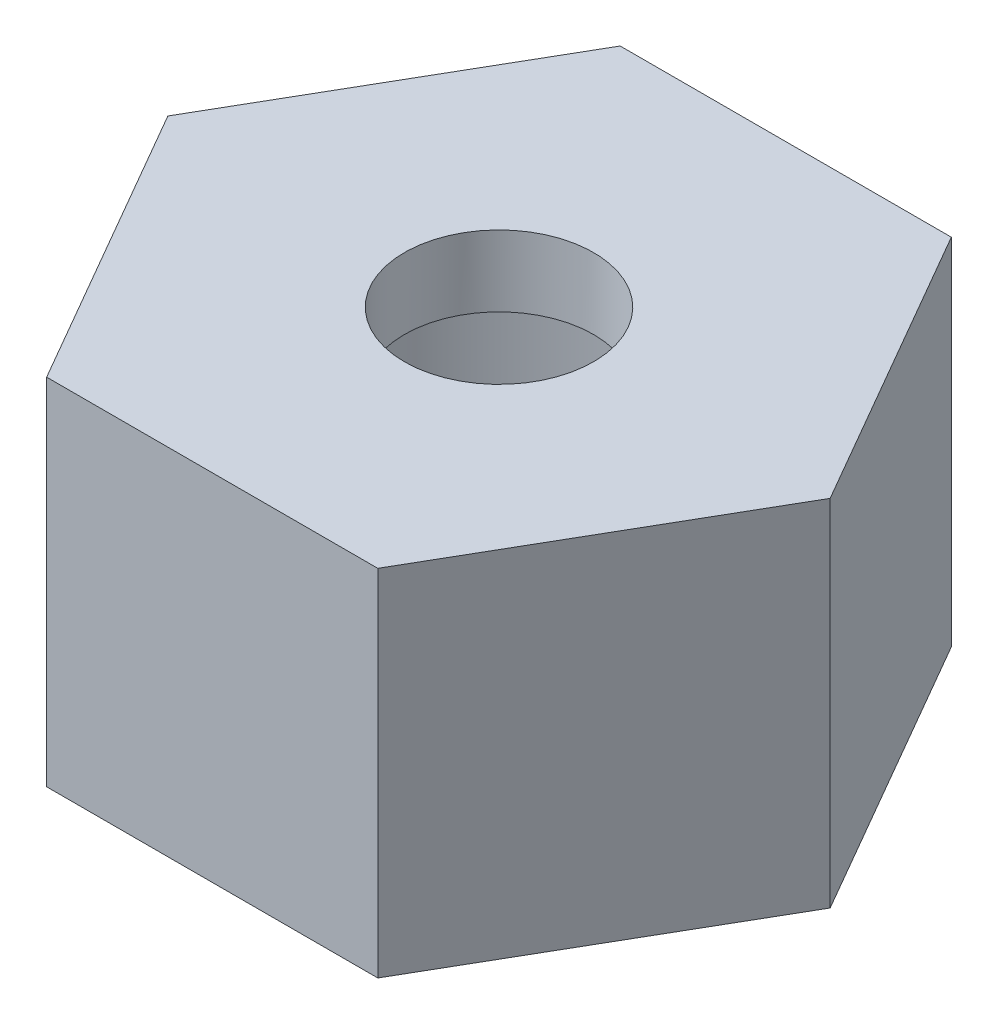
ISO-10303-21;
HEADER;
FILE_DESCRIPTION(('STEP AP214'),'2;1');
FILE_NAME('part.step','',(''),(''),'','','');
FILE_SCHEMA(('AUTOMOTIVE_DESIGN { 1 0 10303 214 1 1 1 1 }'));
ENDSEC;
DATA;
#1=APPLICATION_CONTEXT('core data for automotive mechanical design processes');
#2=APPLICATION_PROTOCOL_DEFINITION('international standard','automotive_design',2000,#1);
#3=PRODUCT_CONTEXT('',#1,'mechanical');
#4=PRODUCT('Part','Part','',(#3));
#5=PRODUCT_RELATED_PRODUCT_CATEGORY('part','',(#4));
#6=PRODUCT_DEFINITION_FORMATION('','',#4);
#7=PRODUCT_DEFINITION_CONTEXT('part definition',#1,'design');
#8=PRODUCT_DEFINITION('design','',#6,#7);
#9=PRODUCT_DEFINITION_SHAPE('','',#8);
#10=(LENGTH_UNIT() NAMED_UNIT(*) SI_UNIT(.MILLI.,.METRE.));
#11=(NAMED_UNIT(*) PLANE_ANGLE_UNIT() SI_UNIT($,.RADIAN.));
#12=(NAMED_UNIT(*) SI_UNIT($,.STERADIAN.) SOLID_ANGLE_UNIT());
#13=UNCERTAINTY_MEASURE_WITH_UNIT(LENGTH_MEASURE(1.E-05),#10,'distance_accuracy_value','');
#14=(GEOMETRIC_REPRESENTATION_CONTEXT(3) GLOBAL_UNCERTAINTY_ASSIGNED_CONTEXT((#13)) GLOBAL_UNIT_ASSIGNED_CONTEXT((#10,
#11,#12)) REPRESENTATION_CONTEXT('',''));
#15=CARTESIAN_POINT('',(0.,0.,0.));
#16=DIRECTION('',(0.,0.,1.));
#17=DIRECTION('',(1.,0.,0.));
#18=AXIS2_PLACEMENT_3D('',#15,#16,#17);
#19=CARTESIAN_POINT('',(-7.00000000000013,7.5,-12.124355652982));
#20=DIRECTION('',(0.866025403784441,0.,0.499999999999995));
#21=DIRECTION('',(0.499999999999995,0.,-0.866025403784441));
#22=AXIS2_PLACEMENT_3D('',#19,#20,#21);
#23=PLANE('',#22);
#24=DIRECTION('',(-0.499999999999995,0.,0.866025403784441));
#25=VECTOR('',#24,1.);
#26=CARTESIAN_POINT('',(-7.00000000000013,-7.5,-12.124355652982));
#27=LINE('',#26,#25);
#28=CARTESIAN_POINT('',(-7.00000000000013,-7.5,-12.124355652982));
#29=VERTEX_POINT('',#28);
#30=CARTESIAN_POINT('',(-14.,-7.5,0.));
#31=VERTEX_POINT('',#30);
#32=EDGE_CURVE('E139',#29,#31,#27,.T.);
#33=ORIENTED_EDGE('',*,*,#32,.T.);
#34=DIRECTION('',(0.,-1.,0.));
#35=VECTOR('',#34,1.);
#36=CARTESIAN_POINT('',(-14.,7.5,0.));
#37=LINE('',#36,#35);
#38=CARTESIAN_POINT('',(-14.,7.5,0.));
#39=VERTEX_POINT('',#38);
#40=EDGE_CURVE('E11',#39,#31,#37,.T.);
#41=ORIENTED_EDGE('',*,*,#40,.F.);
#42=DIRECTION('',(-0.499999999999995,0.,0.866025403784441));
#43=VECTOR('',#42,1.);
#44=CARTESIAN_POINT('',(-7.00000000000013,7.5,-12.124355652982));
#45=LINE('',#44,#43);
#46=CARTESIAN_POINT('',(-7.00000000000013,7.5,-12.124355652982));
#47=VERTEX_POINT('',#46);
#48=EDGE_CURVE('E156',#47,#39,#45,.T.);
#49=ORIENTED_EDGE('',*,*,#48,.F.);
#50=DIRECTION('',(0.,-1.,0.));
#51=VECTOR('',#50,1.);
#52=CARTESIAN_POINT('',(-7.00000000000013,7.5,-12.124355652982));
#53=LINE('',#52,#51);
#54=EDGE_CURVE('E135',#47,#29,#53,.T.);
#55=ORIENTED_EDGE('',*,*,#54,.T.);
#56=EDGE_LOOP('',(#33,#41,#49,#55));
#57=FACE_BOUND('',#56,.T.);
#58=ADVANCED_FACE('F49',(#57),#23,.F.);
#59=CARTESIAN_POINT('',(-14.,7.5,0.));
#60=DIRECTION('',(0.866025403784438,0.,-0.500000000000001));
#61=DIRECTION('',(-0.500000000000001,0.,-0.866025403784438));
#62=AXIS2_PLACEMENT_3D('',#59,#60,#61);
#63=PLANE('',#62);
#64=DIRECTION('',(0.500000000000001,0.,0.866025403784438));
#65=VECTOR('',#64,1.);
#66=CARTESIAN_POINT('',(-14.,-7.5,0.));
#67=LINE('',#66,#65);
#68=CARTESIAN_POINT('',(-6.99999999999996,-7.5,12.1243556529821));
#69=VERTEX_POINT('',#68);
#70=EDGE_CURVE('E143',#31,#69,#67,.T.);
#71=ORIENTED_EDGE('',*,*,#70,.T.);
#72=DIRECTION('',(0.,-1.,0.));
#73=VECTOR('',#72,1.);
#74=CARTESIAN_POINT('',(-6.99999999999996,7.5,12.1243556529821));
#75=LINE('',#74,#73);
#76=CARTESIAN_POINT('',(-6.99999999999996,7.5,12.1243556529821));
#77=VERTEX_POINT('',#76);
#78=EDGE_CURVE('E59',#77,#69,#75,.T.);
#79=ORIENTED_EDGE('',*,*,#78,.F.);
#80=DIRECTION('',(0.500000000000001,0.,0.866025403784438));
#81=VECTOR('',#80,1.);
#82=CARTESIAN_POINT('',(-14.,7.5,0.));
#83=LINE('',#82,#81);
#84=EDGE_CURVE('E104',#39,#77,#83,.T.);
#85=ORIENTED_EDGE('',*,*,#84,.F.);
#86=ORIENTED_EDGE('',*,*,#40,.T.);
#87=EDGE_LOOP('',(#71,#79,#85,#86));
#88=FACE_BOUND('',#87,.T.);
#89=ADVANCED_FACE('F187',(#88),#63,.F.);
#90=CARTESIAN_POINT('',(-6.99999999999996,7.5,12.1243556529821));
#91=DIRECTION('',(0.,0.,-1.));
#92=DIRECTION('',(-1.,0.,0.));
#93=AXIS2_PLACEMENT_3D('',#90,#91,#92);
#94=PLANE('',#93);
#95=DIRECTION('',(1.,0.,0.));
#96=VECTOR('',#95,1.);
#97=CARTESIAN_POINT('',(-6.99999999999996,-7.5,12.1243556529821));
#98=LINE('',#97,#96);
#99=CARTESIAN_POINT('',(7.00000000000004,-7.5,12.1243556529821));
#100=VERTEX_POINT('',#99);
#101=EDGE_CURVE('E147',#69,#100,#98,.T.);
#102=ORIENTED_EDGE('',*,*,#101,.T.);
#103=DIRECTION('',(0.,-1.,0.));
#104=VECTOR('',#103,1.);
#105=CARTESIAN_POINT('',(7.00000000000004,7.5,12.1243556529821));
#106=LINE('',#105,#104);
#107=CARTESIAN_POINT('',(7.00000000000004,7.5,12.1243556529821));
#108=VERTEX_POINT('',#107);
#109=EDGE_CURVE('E128',#108,#100,#106,.T.);
#110=ORIENTED_EDGE('',*,*,#109,.F.);
#111=DIRECTION('',(1.,0.,0.));
#112=VECTOR('',#111,1.);
#113=CARTESIAN_POINT('',(-6.99999999999996,7.5,12.1243556529821));
#114=LINE('',#113,#112);
#115=EDGE_CURVE('E117',#77,#108,#114,.T.);
#116=ORIENTED_EDGE('',*,*,#115,.F.);
#117=ORIENTED_EDGE('',*,*,#78,.T.);
#118=EDGE_LOOP('',(#102,#110,#116,#117));
#119=FACE_BOUND('',#118,.T.);
#120=ADVANCED_FACE('F167',(#119),#94,.F.);
#121=CARTESIAN_POINT('',(7.00000000000004,7.5,12.1243556529821));
#122=DIRECTION('',(-0.866025403784442,0.,-0.499999999999995));
#123=DIRECTION('',(-0.499999999999995,0.,0.866025403784442));
#124=AXIS2_PLACEMENT_3D('',#121,#122,#123);
#125=PLANE('',#124);
#126=DIRECTION('',(0.499999999999995,0.,-0.866025403784442));
#127=VECTOR('',#126,1.);
#128=CARTESIAN_POINT('',(7.00000000000004,-7.5,12.1243556529821));
#129=LINE('',#128,#127);
#130=CARTESIAN_POINT('',(14.,-7.5,0.));
#131=VERTEX_POINT('',#130);
#132=EDGE_CURVE('E126',#100,#131,#129,.T.);
#133=ORIENTED_EDGE('',*,*,#132,.T.);
#134=DIRECTION('',(0.,-1.,0.));
#135=VECTOR('',#134,1.);
#136=CARTESIAN_POINT('',(14.,7.5,0.));
#137=LINE('',#136,#135);
#138=CARTESIAN_POINT('',(14.,7.5,0.));
#139=VERTEX_POINT('',#138);
#140=EDGE_CURVE('E123',#139,#131,#137,.T.);
#141=ORIENTED_EDGE('',*,*,#140,.F.);
#142=DIRECTION('',(0.499999999999995,0.,-0.866025403784442));
#143=VECTOR('',#142,1.);
#144=CARTESIAN_POINT('',(7.00000000000004,7.5,12.1243556529821));
#145=LINE('',#144,#143);
#146=EDGE_CURVE('E111',#108,#139,#145,.T.);
#147=ORIENTED_EDGE('',*,*,#146,.F.);
#148=ORIENTED_EDGE('',*,*,#109,.T.);
#149=EDGE_LOOP('',(#133,#141,#147,#148));
#150=FACE_BOUND('',#149,.T.);
#151=ADVANCED_FACE('F124',(#150),#125,.F.);
#152=CARTESIAN_POINT('',(14.,7.5,0.));
#153=DIRECTION('',(-0.866025403784435,0.,0.500000000000007));
#154=DIRECTION('',(0.500000000000007,0.,0.866025403784435));
#155=AXIS2_PLACEMENT_3D('',#152,#153,#154);
#156=PLANE('',#155);
#157=DIRECTION('',(-0.500000000000007,0.,-0.866025403784435));
#158=VECTOR('',#157,1.);
#159=CARTESIAN_POINT('',(14.,-7.5,0.));
#160=LINE('',#159,#158);
#161=CARTESIAN_POINT('',(6.99999999999987,-7.5,-12.1243556529822));
#162=VERTEX_POINT('',#161);
#163=EDGE_CURVE('E90',#131,#162,#160,.T.);
#164=ORIENTED_EDGE('',*,*,#163,.T.);
#165=DIRECTION('',(0.,-1.,0.));
#166=VECTOR('',#165,1.);
#167=CARTESIAN_POINT('',(6.99999999999987,7.5,-12.1243556529822));
#168=LINE('',#167,#166);
#169=CARTESIAN_POINT('',(6.99999999999987,7.5,-12.1243556529822));
#170=VERTEX_POINT('',#169);
#171=EDGE_CURVE('E129',#170,#162,#168,.T.);
#172=ORIENTED_EDGE('',*,*,#171,.F.);
#173=DIRECTION('',(-0.500000000000007,0.,-0.866025403784435));
#174=VECTOR('',#173,1.);
#175=CARTESIAN_POINT('',(14.,7.5,0.));
#176=LINE('',#175,#174);
#177=EDGE_CURVE('E115',#139,#170,#176,.T.);
#178=ORIENTED_EDGE('',*,*,#177,.F.);
#179=ORIENTED_EDGE('',*,*,#140,.T.);
#180=EDGE_LOOP('',(#164,#172,#178,#179));
#181=FACE_BOUND('',#180,.T.);
#182=ADVANCED_FACE('F131',(#181),#156,.F.);
#183=CARTESIAN_POINT('',(6.99999999999987,7.5,-12.1243556529822));
#184=DIRECTION('',(0.,0.,1.));
#185=DIRECTION('',(1.,0.,0.));
#186=AXIS2_PLACEMENT_3D('',#183,#184,#185);
#187=PLANE('',#186);
#188=DIRECTION('',(-1.,0.,0.));
#189=VECTOR('',#188,1.);
#190=CARTESIAN_POINT('',(6.99999999999987,-7.5,-12.1243556529822));
#191=LINE('',#190,#189);
#192=EDGE_CURVE('E96',#162,#29,#191,.T.);
#193=ORIENTED_EDGE('',*,*,#192,.T.);
#194=ORIENTED_EDGE('',*,*,#54,.F.);
#195=DIRECTION('',(-1.,0.,0.));
#196=VECTOR('',#195,1.);
#197=CARTESIAN_POINT('',(6.99999999999987,7.5,-12.1243556529822));
#198=LINE('',#197,#196);
#199=EDGE_CURVE('E67',#170,#47,#198,.T.);
#200=ORIENTED_EDGE('',*,*,#199,.F.);
#201=ORIENTED_EDGE('',*,*,#171,.T.);
#202=EDGE_LOOP('',(#193,#194,#200,#201));
#203=FACE_BOUND('',#202,.T.);
#204=ADVANCED_FACE('F174',(#203),#187,.F.);
#205=CARTESIAN_POINT('',(0.,7.5,0.));
#206=DIRECTION('',(0.,1.,0.));
#207=DIRECTION('',(0.,0.,1.));
#208=AXIS2_PLACEMENT_3D('',#205,#206,#207);
#209=PLANE('',#208);
#210=CARTESIAN_POINT('',(0.,7.5,0.));
#211=DIRECTION('',(0.,1.,0.));
#212=DIRECTION('',(0.,0.,1.));
#213=AXIS2_PLACEMENT_3D('',#210,#211,#212);
#214=CIRCLE('',#213,4.);
#215=CARTESIAN_POINT('',(0.,7.5,4.));
#216=VERTEX_POINT('',#215);
#217=EDGE_CURVE('E266',#216,#216,#214,.T.);
#218=ORIENTED_EDGE('',*,*,#217,.F.);
#219=EDGE_LOOP('',(#218));
#220=FACE_BOUND('',#219,.T.);
#221=ORIENTED_EDGE('',*,*,#48,.T.);
#222=ORIENTED_EDGE('',*,*,#84,.T.);
#223=ORIENTED_EDGE('',*,*,#115,.T.);
#224=ORIENTED_EDGE('',*,*,#146,.T.);
#225=ORIENTED_EDGE('',*,*,#177,.T.);
#226=ORIENTED_EDGE('',*,*,#199,.T.);
#227=EDGE_LOOP('',(#221,#222,#223,#224,#225,#226));
#228=FACE_BOUND('',#227,.T.);
#229=ADVANCED_FACE('F113',(#220,#228),#209,.T.);
#230=CARTESIAN_POINT('',(0.,-7.5,0.));
#231=DIRECTION('',(0.,1.,0.));
#232=DIRECTION('',(0.,0.,1.));
#233=AXIS2_PLACEMENT_3D('',#230,#231,#232);
#234=PLANE('',#233);
#235=CARTESIAN_POINT('',(0.,-7.5,0.));
#236=DIRECTION('',(0.,-1.,0.));
#237=DIRECTION('',(0.,0.,-1.));
#238=AXIS2_PLACEMENT_3D('',#235,#236,#237);
#239=CIRCLE('',#238,10.);
#240=CARTESIAN_POINT('',(0.,-7.5,-10.));
#241=VERTEX_POINT('',#240);
#242=EDGE_CURVE('E270',#241,#241,#239,.T.);
#243=ORIENTED_EDGE('',*,*,#242,.F.);
#244=EDGE_LOOP('',(#243));
#245=FACE_BOUND('',#244,.T.);
#246=ORIENTED_EDGE('',*,*,#32,.F.);
#247=ORIENTED_EDGE('',*,*,#192,.F.);
#248=ORIENTED_EDGE('',*,*,#163,.F.);
#249=ORIENTED_EDGE('',*,*,#132,.F.);
#250=ORIENTED_EDGE('',*,*,#101,.F.);
#251=ORIENTED_EDGE('',*,*,#70,.F.);
#252=EDGE_LOOP('',(#246,#247,#248,#249,#250,#251));
#253=FACE_BOUND('',#252,.T.);
#254=ADVANCED_FACE('F170',(#245,#253),#234,.F.);
#255=CARTESIAN_POINT('',(0.,4.5,0.));
#256=DIRECTION('',(0.,-1.,0.));
#257=DIRECTION('',(0.,0.,-1.));
#258=AXIS2_PLACEMENT_3D('',#255,#256,#257);
#259=CYLINDRICAL_SURFACE('',#258,10.);
#260=CARTESIAN_POINT('',(0.,4.5,0.));
#261=DIRECTION('',(0.,-1.,0.));
#262=DIRECTION('',(0.,0.,-1.));
#263=AXIS2_PLACEMENT_3D('',#260,#261,#262);
#264=CIRCLE('',#263,10.);
#265=CARTESIAN_POINT('',(0.,4.5,-10.));
#266=VERTEX_POINT('',#265);
#267=EDGE_CURVE('E144',#266,#266,#264,.T.);
#268=ORIENTED_EDGE('',*,*,#267,.F.);
#269=EDGE_LOOP('',(#268));
#270=FACE_BOUND('',#269,.T.);
#271=ORIENTED_EDGE('',*,*,#242,.T.);
#272=EDGE_LOOP('',(#271));
#273=FACE_BOUND('',#272,.T.);
#274=ADVANCED_FACE('F227',(#270,#273),#259,.F.);
#275=CARTESIAN_POINT('',(0.,4.5,0.));
#276=DIRECTION('',(0.,-1.,0.));
#277=DIRECTION('',(0.,0.,-1.));
#278=AXIS2_PLACEMENT_3D('',#275,#276,#277);
#279=PLANE('',#278);
#280=CARTESIAN_POINT('',(0.,4.5,0.));
#281=DIRECTION('',(0.,-1.,0.));
#282=DIRECTION('',(0.,0.,-1.));
#283=AXIS2_PLACEMENT_3D('',#280,#281,#282);
#284=CIRCLE('',#283,4.);
#285=CARTESIAN_POINT('',(0.,4.5,-4.));
#286=VERTEX_POINT('',#285);
#287=EDGE_CURVE('E52',#286,#286,#284,.T.);
#288=ORIENTED_EDGE('',*,*,#287,.F.);
#289=EDGE_LOOP('',(#288));
#290=FACE_BOUND('',#289,.T.);
#291=ORIENTED_EDGE('',*,*,#267,.T.);
#292=EDGE_LOOP('',(#291));
#293=FACE_BOUND('',#292,.T.);
#294=ADVANCED_FACE('F235',(#290,#293),#279,.T.);
#295=CARTESIAN_POINT('',(0.,-7.5,0.));
#296=DIRECTION('',(0.,1.,0.));
#297=DIRECTION('',(0.,0.,1.));
#298=AXIS2_PLACEMENT_3D('',#295,#296,#297);
#299=CYLINDRICAL_SURFACE('',#298,4.);
#300=ORIENTED_EDGE('',*,*,#287,.T.);
#301=EDGE_LOOP('',(#300));
#302=FACE_BOUND('',#301,.T.);
#303=ORIENTED_EDGE('',*,*,#217,.T.);
#304=EDGE_LOOP('',(#303));
#305=FACE_BOUND('',#304,.T.);
#306=ADVANCED_FACE('F244',(#302,#305),#299,.F.);
#307=CLOSED_SHELL('',(#58,#89,#120,#151,#182,#204,#229,#254,#274,#294,#306));
#308=MANIFOLD_SOLID_BREP('B2',#307);
#309=ADVANCED_BREP_SHAPE_REPRESENTATION('',(#18,#308),#14);
#310=SHAPE_DEFINITION_REPRESENTATION(#9,#309);
ENDSEC;
END-ISO-10303-21;
